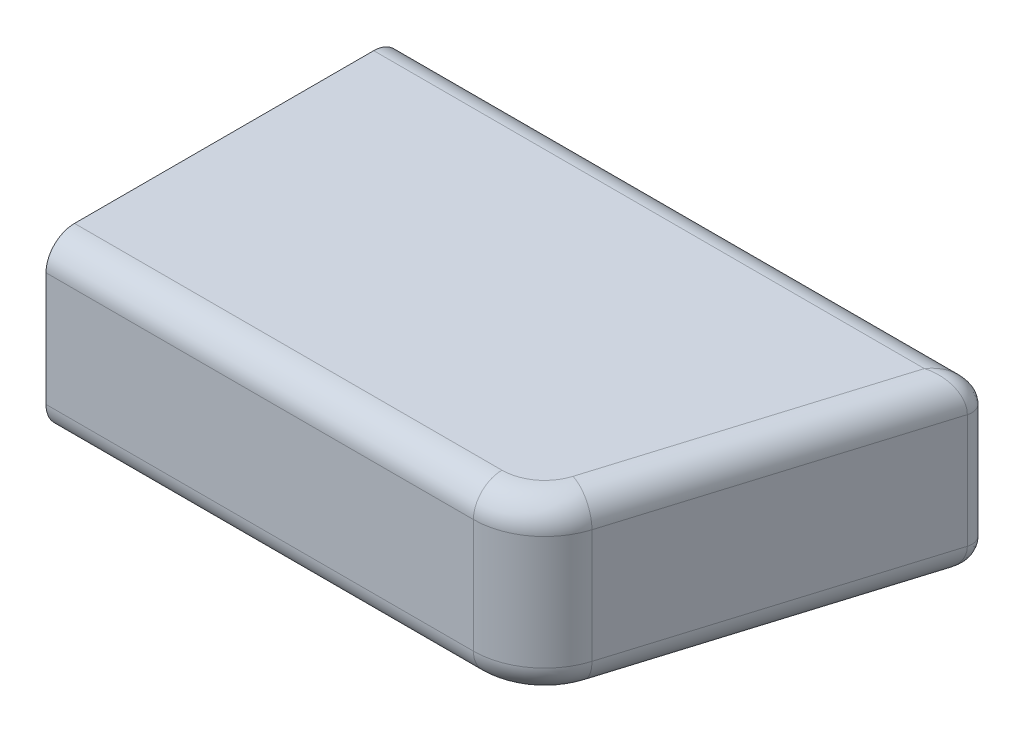
ISO-10303-21;
HEADER;
FILE_DESCRIPTION(('STEP AP214'),'2;1');
FILE_NAME('part.step','',(''),(''),'','','');
FILE_SCHEMA(('AUTOMOTIVE_DESIGN { 1 0 10303 214 1 1 1 1 }'));
ENDSEC;
DATA;
#1=APPLICATION_CONTEXT('core data for automotive mechanical design processes');
#2=APPLICATION_PROTOCOL_DEFINITION('international standard','automotive_design',2000,#1);
#3=PRODUCT_CONTEXT('',#1,'mechanical');
#4=PRODUCT('Part','Part','',(#3));
#5=PRODUCT_RELATED_PRODUCT_CATEGORY('part','',(#4));
#6=PRODUCT_DEFINITION_FORMATION('','',#4);
#7=PRODUCT_DEFINITION_CONTEXT('part definition',#1,'design');
#8=PRODUCT_DEFINITION('design','',#6,#7);
#9=PRODUCT_DEFINITION_SHAPE('','',#8);
#10=(LENGTH_UNIT() NAMED_UNIT(*) SI_UNIT(.MILLI.,.METRE.));
#11=(NAMED_UNIT(*) PLANE_ANGLE_UNIT() SI_UNIT($,.RADIAN.));
#12=(NAMED_UNIT(*) SI_UNIT($,.STERADIAN.) SOLID_ANGLE_UNIT());
#13=UNCERTAINTY_MEASURE_WITH_UNIT(LENGTH_MEASURE(1.E-05),#10,'distance_accuracy_value','');
#14=(GEOMETRIC_REPRESENTATION_CONTEXT(3) GLOBAL_UNCERTAINTY_ASSIGNED_CONTEXT((#13)) GLOBAL_UNIT_ASSIGNED_CONTEXT((#10,
#11,#12)) REPRESENTATION_CONTEXT('',''));
#15=CARTESIAN_POINT('',(0.,0.,0.));
#16=DIRECTION('',(0.,0.,1.));
#17=DIRECTION('',(1.,0.,0.));
#18=AXIS2_PLACEMENT_3D('',#15,#16,#17);
#19=CARTESIAN_POINT('',(32.3335021986805,12.,-16.8831167441114));
#20=DIRECTION('',(0.,0.,1.));
#21=DIRECTION('',(1.,0.,0.));
#22=AXIS2_PLACEMENT_3D('',#19,#20,#21);
#23=PLANE('',#22);
#24=DIRECTION('',(0.,-1.,0.));
#25=VECTOR('',#24,1.);
#26=CARTESIAN_POINT('',(32.3335021986805,12.,-16.8831167441114));
#27=LINE('',#26,#25);
#28=CARTESIAN_POINT('',(32.3335021986805,10.,-16.8831167441114));
#29=VERTEX_POINT('',#28);
#30=CARTESIAN_POINT('',(32.3335021986805,2.,-16.8831167441114));
#31=VERTEX_POINT('',#30);
#32=EDGE_CURVE('E195',#29,#31,#27,.T.);
#33=ORIENTED_EDGE('',*,*,#32,.T.);
#34=DIRECTION('',(-1.,0.,0.));
#35=VECTOR('',#34,1.);
#36=CARTESIAN_POINT('',(32.3335021986805,2.,-16.8831167441114));
#37=LINE('',#36,#35);
#38=CARTESIAN_POINT('',(-7.66649780131954,2.,-16.8831167441114));
#39=VERTEX_POINT('',#38);
#40=EDGE_CURVE('E225',#31,#39,#37,.T.);
#41=ORIENTED_EDGE('',*,*,#40,.T.);
#42=DIRECTION('',(0.,-1.,0.));
#43=VECTOR('',#42,1.);
#44=CARTESIAN_POINT('',(-7.66649780131954,12.,-16.8831167441114));
#45=LINE('',#44,#43);
#46=CARTESIAN_POINT('',(-7.66649780131954,10.,-16.8831167441114));
#47=VERTEX_POINT('',#46);
#48=EDGE_CURVE('E148',#47,#39,#45,.T.);
#49=ORIENTED_EDGE('',*,*,#48,.F.);
#50=DIRECTION('',(-1.,0.,0.));
#51=VECTOR('',#50,1.);
#52=CARTESIAN_POINT('',(32.3335021986805,10.,-16.8831167441114));
#53=LINE('',#52,#51);
#54=EDGE_CURVE('E223',#47,#29,#53,.F.);
#55=ORIENTED_EDGE('',*,*,#54,.T.);
#56=EDGE_LOOP('',(#33,#41,#49,#55));
#57=FACE_BOUND('',#56,.T.);
#58=ADVANCED_FACE('F35',(#57),#23,.F.);
#59=CARTESIAN_POINT('',(-7.66649780131954,12.,-16.8831167441114));
#60=DIRECTION('',(1.,0.,0.));
#61=DIRECTION('',(0.,0.,-1.));
#62=AXIS2_PLACEMENT_3D('',#59,#60,#61);
#63=PLANE('',#62);
#64=DIRECTION('',(0.,0.,1.));
#65=VECTOR('',#64,1.);
#66=CARTESIAN_POINT('',(-7.66649780131954,0.,-16.8831167441114));
#67=LINE('',#66,#65);
#68=CARTESIAN_POINT('',(-7.66649780131954,0.,-14.8831167441114));
#69=VERTEX_POINT('',#68);
#70=CARTESIAN_POINT('',(-7.66649780131953,0.,6.11688325588859));
#71=VERTEX_POINT('',#70);
#72=EDGE_CURVE('E183',#69,#71,#67,.T.);
#73=ORIENTED_EDGE('',*,*,#72,.T.);
#74=CARTESIAN_POINT('',(-7.66649780131953,2.,6.11688325588859));
#75=DIRECTION('',(1.,0.,0.));
#76=DIRECTION('',(0.,0.,-1.));
#77=AXIS2_PLACEMENT_3D('',#74,#75,#76);
#78=CIRCLE('',#77,2.);
#79=CARTESIAN_POINT('',(-7.66649780131953,2.,8.11688325588859));
#80=VERTEX_POINT('',#79);
#81=EDGE_CURVE('E133',#71,#80,#78,.F.);
#82=ORIENTED_EDGE('',*,*,#81,.T.);
#83=DIRECTION('',(0.,-1.,0.));
#84=VECTOR('',#83,1.);
#85=CARTESIAN_POINT('',(-7.66649780131953,12.,8.11688325588859));
#86=LINE('',#85,#84);
#87=CARTESIAN_POINT('',(-7.66649780131953,10.,8.11688325588859));
#88=VERTEX_POINT('',#87);
#89=EDGE_CURVE('E143',#88,#80,#86,.T.);
#90=ORIENTED_EDGE('',*,*,#89,.F.);
#91=CARTESIAN_POINT('',(-7.66649780131954,10.,6.11688325588859));
#92=DIRECTION('',(1.,0.,0.));
#93=DIRECTION('',(0.,0.,-1.));
#94=AXIS2_PLACEMENT_3D('',#91,#92,#93);
#95=CIRCLE('',#94,2.);
#96=CARTESIAN_POINT('',(-7.66649780131953,12.,6.11688325588859));
#97=VERTEX_POINT('',#96);
#98=EDGE_CURVE('E147',#88,#97,#95,.F.);
#99=ORIENTED_EDGE('',*,*,#98,.T.);
#100=DIRECTION('',(0.,0.,1.));
#101=VECTOR('',#100,1.);
#102=CARTESIAN_POINT('',(-7.66649780131954,12.,-16.8831167441114));
#103=LINE('',#102,#101);
#104=CARTESIAN_POINT('',(-7.66649780131954,12.,-14.8831167441114));
#105=VERTEX_POINT('',#104);
#106=EDGE_CURVE('E189',#105,#97,#103,.T.);
#107=ORIENTED_EDGE('',*,*,#106,.F.);
#108=CARTESIAN_POINT('',(-7.66649780131954,10.,-14.8831167441114));
#109=DIRECTION('',(1.,0.,0.));
#110=DIRECTION('',(0.,0.,-1.));
#111=AXIS2_PLACEMENT_3D('',#108,#109,#110);
#112=CIRCLE('',#111,2.);
#113=EDGE_CURVE('E216',#105,#47,#112,.F.);
#114=ORIENTED_EDGE('',*,*,#113,.T.);
#115=ORIENTED_EDGE('',*,*,#48,.T.);
#116=CARTESIAN_POINT('',(-7.66649780131953,2.,-14.8831167441114));
#117=DIRECTION('',(1.,0.,0.));
#118=DIRECTION('',(0.,0.,-1.));
#119=AXIS2_PLACEMENT_3D('',#116,#117,#118);
#120=CIRCLE('',#119,2.);
#121=EDGE_CURVE('E219',#39,#69,#120,.F.);
#122=ORIENTED_EDGE('',*,*,#121,.T.);
#123=EDGE_LOOP('',(#73,#82,#90,#99,#107,#114,#115,#122));
#124=FACE_BOUND('',#123,.T.);
#125=ADVANCED_FACE('F254',(#124),#63,.F.);
#126=CARTESIAN_POINT('',(-7.66649780131953,12.,8.11688325588859));
#127=DIRECTION('',(0.,0.,-1.));
#128=DIRECTION('',(-1.,0.,0.));
#129=AXIS2_PLACEMENT_3D('',#126,#127,#128);
#130=PLANE('',#129);
#131=ORIENTED_EDGE('',*,*,#89,.T.);
#132=DIRECTION('',(1.,0.,0.));
#133=VECTOR('',#132,1.);
#134=CARTESIAN_POINT('',(-7.66649780131953,2.,8.11688325588859));
#135=LINE('',#134,#133);
#136=CARTESIAN_POINT('',(22.3335021986805,2.,8.11688325588859));
#137=VERTEX_POINT('',#136);
#138=EDGE_CURVE('E142',#80,#137,#135,.T.);
#139=ORIENTED_EDGE('',*,*,#138,.T.);
#140=DIRECTION('',(0.,-1.,0.));
#141=VECTOR('',#140,1.);
#142=CARTESIAN_POINT('',(22.3335021986805,12.,8.11688325588859));
#143=LINE('',#142,#141);
#144=CARTESIAN_POINT('',(22.3335021986805,10.,8.11688325588859));
#145=VERTEX_POINT('',#144);
#146=EDGE_CURVE('E126',#145,#137,#143,.T.);
#147=ORIENTED_EDGE('',*,*,#146,.F.);
#148=DIRECTION('',(1.,0.,0.));
#149=VECTOR('',#148,1.);
#150=CARTESIAN_POINT('',(-7.66649780131953,10.,8.11688325588859));
#151=LINE('',#150,#149);
#152=EDGE_CURVE('E139',#145,#88,#151,.F.);
#153=ORIENTED_EDGE('',*,*,#152,.T.);
#154=EDGE_LOOP('',(#131,#139,#147,#153));
#155=FACE_BOUND('',#154,.T.);
#156=ADVANCED_FACE('F138',(#155),#130,.F.);
#157=CARTESIAN_POINT('',(22.3335021986805,12.,3.11688325588859));
#158=DIRECTION('',(0.,-1.,0.));
#159=DIRECTION('',(0.,0.,-1.));
#160=AXIS2_PLACEMENT_3D('',#157,#158,#159);
#161=CYLINDRICAL_SURFACE('',#160,5.);
#162=ORIENTED_EDGE('',*,*,#146,.T.);
#163=CARTESIAN_POINT('',(22.3335021986805,2.,3.11688325588859));
#164=DIRECTION('',(0.,1.,0.));
#165=DIRECTION('',(0.,0.,1.));
#166=AXIS2_PLACEMENT_3D('',#163,#164,#165);
#167=CIRCLE('',#166,5.);
#168=CARTESIAN_POINT('',(27.1144722538307,2.,4.58055170596766));
#169=VERTEX_POINT('',#168);
#170=EDGE_CURVE('E132',#137,#169,#167,.T.);
#171=ORIENTED_EDGE('',*,*,#170,.T.);
#172=DIRECTION('',(0.,-1.,0.));
#173=VECTOR('',#172,1.);
#174=CARTESIAN_POINT('',(27.1144722538307,12.,4.58055170596766));
#175=LINE('',#174,#173);
#176=CARTESIAN_POINT('',(27.1144722538307,10.,4.58055170596766));
#177=VERTEX_POINT('',#176);
#178=EDGE_CURVE('E128',#177,#169,#175,.T.);
#179=ORIENTED_EDGE('',*,*,#178,.F.);
#180=CARTESIAN_POINT('',(22.3335021986805,10.,3.11688325588859));
#181=DIRECTION('',(0.,1.,0.));
#182=DIRECTION('',(0.,0.,1.));
#183=AXIS2_PLACEMENT_3D('',#180,#181,#182);
#184=CIRCLE('',#183,5.);
#185=EDGE_CURVE('E123',#177,#145,#184,.F.);
#186=ORIENTED_EDGE('',*,*,#185,.T.);
#187=EDGE_LOOP('',(#162,#171,#179,#186));
#188=FACE_BOUND('',#187,.T.);
#189=ADVANCED_FACE('F125',(#188),#161,.T.);
#190=CARTESIAN_POINT('',(27.1144722538307,12.,4.58055170596766));
#191=DIRECTION('',(-0.956194011030045,0.,-0.292733690015813));
#192=DIRECTION('',(-0.292733690015813,0.,0.956194011030045));
#193=AXIS2_PLACEMENT_3D('',#190,#191,#192);
#194=PLANE('',#193);
#195=ORIENTED_EDGE('',*,*,#178,.T.);
#196=DIRECTION('',(0.292733690015813,0.,-0.956194011030045));
#197=VECTOR('',#196,1.);
#198=CARTESIAN_POINT('',(27.1144722538307,2.,4.58055170596766));
#199=LINE('',#198,#197);
#200=CARTESIAN_POINT('',(33.2896962097105,2.,-15.5903830540956));
#201=VERTEX_POINT('',#200);
#202=EDGE_CURVE('E11',#169,#201,#199,.T.);
#203=ORIENTED_EDGE('',*,*,#202,.T.);
#204=DIRECTION('',(0.,-1.,0.));
#205=VECTOR('',#204,1.);
#206=CARTESIAN_POINT('',(33.2896962097105,12.,-15.5903830540956));
#207=LINE('',#206,#205);
#208=CARTESIAN_POINT('',(33.2896962097105,10.,-15.5903830540956));
#209=VERTEX_POINT('',#208);
#210=EDGE_CURVE('E200',#209,#201,#207,.T.);
#211=ORIENTED_EDGE('',*,*,#210,.F.);
#212=DIRECTION('',(0.292733690015813,0.,-0.956194011030045));
#213=VECTOR('',#212,1.);
#214=CARTESIAN_POINT('',(27.1144722538307,10.,4.58055170596766));
#215=LINE('',#214,#213);
#216=EDGE_CURVE('E45',#209,#177,#215,.F.);
#217=ORIENTED_EDGE('',*,*,#216,.T.);
#218=EDGE_LOOP('',(#195,#203,#211,#217));
#219=FACE_BOUND('',#218,.T.);
#220=ADVANCED_FACE('F239',(#219),#194,.F.);
#221=CARTESIAN_POINT('',(32.3335021986805,12.,-15.8831167441114));
#222=DIRECTION('',(0.,-1.,0.));
#223=DIRECTION('',(0.,0.,-1.));
#224=AXIS2_PLACEMENT_3D('',#221,#222,#223);
#225=CYLINDRICAL_SURFACE('',#224,1.);
#226=ORIENTED_EDGE('',*,*,#210,.T.);
#227=CARTESIAN_POINT('',(32.3335021986805,2.,-15.8831167441114));
#228=DIRECTION('',(0.,1.,0.));
#229=DIRECTION('',(0.,0.,1.));
#230=AXIS2_PLACEMENT_3D('',#227,#228,#229);
#231=CIRCLE('',#230,1.);
#232=EDGE_CURVE('E229',#201,#31,#231,.T.);
#233=ORIENTED_EDGE('',*,*,#232,.T.);
#234=ORIENTED_EDGE('',*,*,#32,.F.);
#235=CARTESIAN_POINT('',(32.3335021986805,10.,-15.8831167441114));
#236=DIRECTION('',(0.,-1.,0.));
#237=DIRECTION('',(0.,0.,-1.));
#238=AXIS2_PLACEMENT_3D('',#235,#236,#237);
#239=CIRCLE('',#238,1.);
#240=EDGE_CURVE('E227',#29,#209,#239,.T.);
#241=ORIENTED_EDGE('',*,*,#240,.T.);
#242=EDGE_LOOP('',(#226,#233,#234,#241));
#243=FACE_BOUND('',#242,.T.);
#244=ADVANCED_FACE('F246',(#243),#225,.T.);
#245=CARTESIAN_POINT('',(22.3335021986805,12.,3.11688325588859));
#246=DIRECTION('',(0.,1.,0.));
#247=DIRECTION('',(0.,0.,1.));
#248=AXIS2_PLACEMENT_3D('',#245,#246,#247);
#249=PLANE('',#248);
#250=ORIENTED_EDGE('',*,*,#106,.T.);
#251=DIRECTION('',(1.,0.,0.));
#252=VECTOR('',#251,1.);
#253=CARTESIAN_POINT('',(22.3335021986805,12.,6.11688325588859));
#254=LINE('',#253,#252);
#255=CARTESIAN_POINT('',(22.3335021986805,12.,6.11688325588859));
#256=VERTEX_POINT('',#255);
#257=EDGE_CURVE('E235',#97,#256,#254,.T.);
#258=ORIENTED_EDGE('',*,*,#257,.T.);
#259=CARTESIAN_POINT('',(22.3335021986805,12.,3.11688325588859));
#260=DIRECTION('',(0.,1.,0.));
#261=DIRECTION('',(0.,0.,1.));
#262=AXIS2_PLACEMENT_3D('',#259,#260,#261);
#263=CIRCLE('',#262,3.);
#264=CARTESIAN_POINT('',(25.2020842317706,12.,3.99508432593603));
#265=VERTEX_POINT('',#264);
#266=EDGE_CURVE('E151',#256,#265,#263,.T.);
#267=ORIENTED_EDGE('',*,*,#266,.T.);
#268=DIRECTION('',(0.292733690015813,0.,-0.956194011030045));
#269=VECTOR('',#268,1.);
#270=CARTESIAN_POINT('',(31.3773081876504,12.,-16.1758504341272));
#271=LINE('',#270,#269);
#272=CARTESIAN_POINT('',(30.9815446721705,12.,-14.8831167441114));
#273=VERTEX_POINT('',#272);
#274=EDGE_CURVE('E61',#265,#273,#271,.T.);
#275=ORIENTED_EDGE('',*,*,#274,.T.);
#276=DIRECTION('',(-1.,0.,0.));
#277=VECTOR('',#276,1.);
#278=CARTESIAN_POINT('',(-7.66649780131954,12.,-14.8831167441114));
#279=LINE('',#278,#277);
#280=EDGE_CURVE('E232',#273,#105,#279,.T.);
#281=ORIENTED_EDGE('',*,*,#280,.T.);
#282=EDGE_LOOP('',(#250,#258,#267,#275,#281));
#283=FACE_BOUND('',#282,.T.);
#284=ADVANCED_FACE('F253',(#283),#249,.T.);
#285=CARTESIAN_POINT('',(22.3335021986805,0.,3.11688325588859));
#286=DIRECTION('',(0.,1.,0.));
#287=DIRECTION('',(0.,0.,1.));
#288=AXIS2_PLACEMENT_3D('',#285,#286,#287);
#289=PLANE('',#288);
#290=CARTESIAN_POINT('',(22.3335021986805,0.,3.11688325588859));
#291=DIRECTION('',(0.,1.,0.));
#292=DIRECTION('',(0.,0.,1.));
#293=AXIS2_PLACEMENT_3D('',#290,#291,#292);
#294=CIRCLE('',#293,3.);
#295=CARTESIAN_POINT('',(25.2020842317706,0.,3.99508432593603));
#296=VERTEX_POINT('',#295);
#297=CARTESIAN_POINT('',(22.3335021986805,0.,6.11688325588859));
#298=VERTEX_POINT('',#297);
#299=EDGE_CURVE('E212',#296,#298,#294,.F.);
#300=ORIENTED_EDGE('',*,*,#299,.T.);
#301=DIRECTION('',(1.,0.,0.));
#302=VECTOR('',#301,1.);
#303=CARTESIAN_POINT('',(22.3335021986805,0.,6.11688325588859));
#304=LINE('',#303,#302);
#305=EDGE_CURVE('E214',#298,#71,#304,.F.);
#306=ORIENTED_EDGE('',*,*,#305,.T.);
#307=ORIENTED_EDGE('',*,*,#72,.F.);
#308=DIRECTION('',(-1.,0.,0.));
#309=VECTOR('',#308,1.);
#310=CARTESIAN_POINT('',(22.3335021986805,0.,-14.8831167441114));
#311=LINE('',#310,#309);
#312=CARTESIAN_POINT('',(30.9815446721705,0.,-14.8831167441114));
#313=VERTEX_POINT('',#312);
#314=EDGE_CURVE('E210',#69,#313,#311,.F.);
#315=ORIENTED_EDGE('',*,*,#314,.T.);
#316=DIRECTION('',(0.292733690015813,0.,-0.956194011030045));
#317=VECTOR('',#316,1.);
#318=CARTESIAN_POINT('',(25.2020842317706,0.,3.99508432593603));
#319=LINE('',#318,#317);
#320=EDGE_CURVE('E208',#313,#296,#319,.F.);
#321=ORIENTED_EDGE('',*,*,#320,.T.);
#322=EDGE_LOOP('',(#300,#306,#307,#315,#321));
#323=FACE_BOUND('',#322,.T.);
#324=ADVANCED_FACE('F274',(#323),#289,.F.);
#325=CARTESIAN_POINT('',(32.3335021986805,2.,-14.8831167441114));
#326=DIRECTION('',(-1.,0.,0.));
#327=DIRECTION('',(0.,0.,1.));
#328=AXIS2_PLACEMENT_3D('',#325,#326,#327);
#329=CYLINDRICAL_SURFACE('',#328,2.);
#330=ORIENTED_EDGE('',*,*,#121,.F.);
#331=ORIENTED_EDGE('',*,*,#40,.F.);
#332=CARTESIAN_POINT('',(30.9815446721705,2.,-14.8831167441114));
#333=DIRECTION('',(0.828472467690034,0.,0.560029794099908));
#334=DIRECTION('',(0.560029794099908,0.,-0.828472467690034));
#335=AXIS2_PLACEMENT_3D('',#332,#333,#334);
#336=ELLIPSE('',#335,2.41408143058326,2.);
#337=EDGE_CURVE('E181',#313,#31,#336,.T.);
#338=ORIENTED_EDGE('',*,*,#337,.F.);
#339=ORIENTED_EDGE('',*,*,#314,.F.);
#340=EDGE_LOOP('',(#330,#331,#338,#339));
#341=FACE_BOUND('',#340,.T.);
#342=ADVANCED_FACE('F267',(#341),#329,.T.);
#343=CARTESIAN_POINT('',(30.9815446721705,4.,-14.8831167441114));
#344=CARTESIAN_POINT('',(30.9815446721705,4.,-14.8831167441114));
#345=CARTESIAN_POINT('',(30.9815446721705,4.,-14.8831167441114));
#346=CARTESIAN_POINT('',(31.0820571781341,3.99994233991153,-14.9139158957459));
#347=CARTESIAN_POINT('',(31.0612532713887,3.99999437343622,-14.9420746608027));
#348=CARTESIAN_POINT('',(31.0404180332717,3.99994233991153,-14.9702102510401));
#349=CARTESIAN_POINT('',(31.1825944055609,3.99430697680965,-14.9447226225582));
#350=CARTESIAN_POINT('',(31.1412471328849,3.99798229289744,-15.0012435769319));
#351=CARTESIAN_POINT('',(31.0993058745176,3.99430697680965,-15.0573251789741));
#352=CARTESIAN_POINT('',(31.3819400433067,3.97159815969771,-15.00580633016));
#353=CARTESIAN_POINT('',(31.3006766707529,3.9898912762768,-15.1191685373998));
#354=CARTESIAN_POINT('',(31.2160689340239,3.97159815969771,-15.2300570247854));
#355=CARTESIAN_POINT('',(31.4807553013194,3.9546513090683,-15.0360854092274));
#356=CARTESIAN_POINT('',(31.3807026204632,3.98379752930757,-15.1783611881607));
#357=CARTESIAN_POINT('',(31.2739481631956,3.9546513090683,-15.3156798761499));
#358=CARTESIAN_POINT('',(31.6749746317223,3.90955046295957,-15.0955983081457));
#359=CARTESIAN_POINT('',(31.5403033172648,3.96739805696633,-15.2964127494502));
#360=CARTESIAN_POINT('',(31.3877085819815,3.90955046295957,-15.4839698062036));
#361=CARTESIAN_POINT('',(31.7704060501632,3.88164958866861,-15.1248405074032));
#362=CARTESIAN_POINT('',(31.6204739382346,3.95706240582472,-15.3557124089423));
#363=CARTESIAN_POINT('',(31.4436057890445,3.8816495886686,-15.566660580088));
#364=CARTESIAN_POINT('',(31.9561978746066,3.81496967869212,-15.1817710407595));
#365=CARTESIAN_POINT('',(31.7806530426299,3.93178815925032,-15.4741917999398));
#366=CARTESIAN_POINT('',(31.5524299504287,3.81496967869211,-15.7276481248152));
#367=CARTESIAN_POINT('',(32.0466222992479,3.77657353944393,-15.2094789915194));
#368=CARTESIAN_POINT('',(31.8612636268667,3.91680520063407,-15.5338168862728));
#369=CARTESIAN_POINT('',(31.605394402496,3.77657353944393,-15.8060003674393));
#370=CARTESIAN_POINT('',(32.2208154064173,3.6894306749134,-15.2628554332862));
#371=CARTESIAN_POINT('',(32.0228483042158,3.88138384030836,-15.6533359348972));
#372=CARTESIAN_POINT('',(31.7074248274805,3.6894306749134,-15.9569376905191));
#373=CARTESIAN_POINT('',(32.3047033836669,3.64119637962372,-15.2885604787116));
#374=CARTESIAN_POINT('',(32.1044217453433,3.86089149232359,-15.7136732158605));
#375=CARTESIAN_POINT('',(31.7565606750978,3.64119637962373,-16.0296261391632));
#376=CARTESIAN_POINT('',(32.464329621962,3.53506503306765,-15.3374733246403));
#377=CARTESIAN_POINT('',(32.2686830844752,3.8127482404957,-15.8351721061074));
#378=CARTESIAN_POINT('',(31.8500588231967,3.53506503306766,-16.1679413543464));
#379=CARTESIAN_POINT('',(32.5402646753155,3.47780480378089,-15.3607414264569));
#380=CARTESIAN_POINT('',(32.3519453535642,3.78504942103507,-15.8967585594215));
#381=CARTESIAN_POINT('',(31.8945363911715,3.47780480378089,-16.2337386402857));
#382=CARTESIAN_POINT('',(32.6826037812164,3.35446961303308,-15.4043571304346));
#383=CARTESIAN_POINT('',(32.5203384284106,3.71935460810268,-16.0213135632174));
#384=CARTESIAN_POINT('',(31.9779089178058,3.35446961303308,-16.3570746549155));
#385=CARTESIAN_POINT('',(32.749306518152,3.2891375350601,-15.4247962557914));
#386=CARTESIAN_POINT('',(32.6059756748777,3.68135614170703,-16.0846567117912));
#387=CARTESIAN_POINT('',(32.01697882538,3.2891375350601,-16.4148721919063));
#388=CARTESIAN_POINT('',(32.8719307065929,3.15066411414271,-15.4623708932721));
#389=CARTESIAN_POINT('',(32.7791877061324,3.58977920702354,-16.2127761444348));
#390=CARTESIAN_POINT('',(32.0888036998731,3.15066411414271,-16.5211253442202));
#391=CARTESIAN_POINT('',(32.9282739650429,3.07832951833868,-15.4796356559396));
#392=CARTESIAN_POINT('',(32.8671307054857,3.53633109530218,-16.2778247851124));
#393=CARTESIAN_POINT('',(32.1218057324912,3.07832951833868,-16.569946452829));
#394=CARTESIAN_POINT('',(33.0290822734341,2.92702693289033,-15.5105254476764));
#395=CARTESIAN_POINT('',(33.0427983853241,3.40609335261255,-16.4077605829416));
#396=CARTESIAN_POINT('',(32.1808523544515,2.92702693289032,-16.6572962708558));
#397=CARTESIAN_POINT('',(33.0740961189399,2.84885081739926,-15.5243186392807));
#398=CARTESIAN_POINT('',(33.1306585562061,3.32974106571898,-16.4727479580324));
#399=CARTESIAN_POINT('',(32.2072183907533,2.84885081739926,-16.6963005084665));
#400=CARTESIAN_POINT('',(33.1513396721131,2.68724203502928,-15.5479876930384));
#401=CARTESIAN_POINT('',(33.2992963588088,3.14493717552186,-16.5974839791691));
#402=CARTESIAN_POINT('',(32.2524623885534,2.68724203502928,-16.7632316019558));
#403=CARTESIAN_POINT('',(33.1842045446853,2.60446895238427,-15.5580581831142));
#404=CARTESIAN_POINT('',(33.3798980092855,3.03752773392134,-16.6571024574839));
#405=CARTESIAN_POINT('',(32.271712386272,2.60446895238428,-16.7917088245624));
#406=CARTESIAN_POINT('',(33.2365088691816,2.43527857193943,-15.5740853312373));
#407=CARTESIAN_POINT('',(33.5206400745686,2.78637561663043,-16.7612048886056));
#408=CARTESIAN_POINT('',(32.3023486872348,2.43527857193943,-16.8370302201862));
#409=CARTESIAN_POINT('',(33.2565525128976,2.3492684236929,-15.5802271263921));
#410=CARTESIAN_POINT('',(33.5803425710979,2.64464616239631,-16.8053649271857));
#411=CARTESIAN_POINT('',(32.3140888847651,2.34926842369291,-16.8543979219077));
#412=CARTESIAN_POINT('',(33.2829543270673,2.17542061745816,-15.5883171990675));
#413=CARTESIAN_POINT('',(33.6629545315908,2.33381348440849,-16.8664703679063));
#414=CARTESIAN_POINT('',(32.3295532642911,2.17542061745816,-16.8772749416703));
#415=CARTESIAN_POINT('',(33.2896962097105,2.08771030872908,-15.5903830540956));
#416=CARTESIAN_POINT('',(33.6854597251904,2.16780878715313,-16.8831167441114));
#417=CARTESIAN_POINT('',(32.3335021986805,2.08771030872908,-16.8831167441114));
#418=CARTESIAN_POINT('',(33.2896962097105,1.91228969127092,-15.5903830540956));
#419=CARTESIAN_POINT('',(33.6854597251904,1.83219121284687,-16.8831167441114));
#420=CARTESIAN_POINT('',(32.3335021986805,1.91228969127092,-16.8831167441114));
#421=CARTESIAN_POINT('',(33.2829543270673,1.82457938254184,-15.5883171990675));
#422=CARTESIAN_POINT('',(33.6629545315908,1.66618651559151,-16.8664703679063));
#423=CARTESIAN_POINT('',(32.3295532642911,1.82457938254184,-16.8772749416703));
#424=CARTESIAN_POINT('',(33.2565525128976,1.6507315763071,-15.5802271263921));
#425=CARTESIAN_POINT('',(33.5803425710979,1.35535383760369,-16.8053649271857));
#426=CARTESIAN_POINT('',(32.3140888847651,1.6507315763071,-16.8543979219077));
#427=CARTESIAN_POINT('',(33.2365088691816,1.56472142806057,-15.5740853312373));
#428=CARTESIAN_POINT('',(33.5206400745686,1.21362438336958,-16.7612048886056));
#429=CARTESIAN_POINT('',(32.3023486872348,1.56472142806057,-16.8370302201862));
#430=CARTESIAN_POINT('',(33.1842045446853,1.39553104761573,-15.5580581831142));
#431=CARTESIAN_POINT('',(33.3798980092855,0.962472266078665,-16.6571024574839));
#432=CARTESIAN_POINT('',(32.271712386272,1.39553104761572,-16.7917088245624));
#433=CARTESIAN_POINT('',(33.1513396721131,1.31275796497072,-15.5479876930384));
#434=CARTESIAN_POINT('',(33.2992963588088,0.855062824478137,-16.5974839791691));
#435=CARTESIAN_POINT('',(32.2524623885534,1.31275796497072,-16.7632316019558));
#436=CARTESIAN_POINT('',(33.0740961189399,1.15114918260073,-15.5243186392807));
#437=CARTESIAN_POINT('',(33.1306585562061,0.670258934281022,-16.4727479580324));
#438=CARTESIAN_POINT('',(32.2072183907533,1.15114918260074,-16.6963005084665));
#439=CARTESIAN_POINT('',(33.0290822734341,1.07297306710967,-15.5105254476764));
#440=CARTESIAN_POINT('',(33.0427983853241,0.593906647387446,-16.4077605829416));
#441=CARTESIAN_POINT('',(32.1808523544515,1.07297306710968,-16.6572962708558));
#442=CARTESIAN_POINT('',(32.9282739650429,0.921670481661319,-15.4796356559396));
#443=CARTESIAN_POINT('',(32.8671307054857,0.463668904697818,-16.2778247851124));
#444=CARTESIAN_POINT('',(32.1218057324912,0.921670481661319,-16.569946452829));
#445=CARTESIAN_POINT('',(32.8719307065929,0.849335885857293,-15.4623708932721));
#446=CARTESIAN_POINT('',(32.7791877061324,0.410220792976459,-16.2127761444347));
#447=CARTESIAN_POINT('',(32.0888036998731,0.849335885857291,-16.5211253442202));
#448=CARTESIAN_POINT('',(32.749306518152,0.710862464939901,-15.4247962557914));
#449=CARTESIAN_POINT('',(32.6059756748777,0.31864385829297,-16.0846567117912));
#450=CARTESIAN_POINT('',(32.01697882538,0.710862464939899,-16.4148721919063));
#451=CARTESIAN_POINT('',(32.6826037812164,0.645530386966918,-15.4043571304346));
#452=CARTESIAN_POINT('',(32.5203384284106,0.280645391897316,-16.0213135632174));
#453=CARTESIAN_POINT('',(31.9779089178058,0.64553038696692,-16.3570746549155));
#454=CARTESIAN_POINT('',(32.5402646753155,0.522195196219112,-15.3607414264569));
#455=CARTESIAN_POINT('',(32.3519453535642,0.214950578964932,-15.8967585594215));
#456=CARTESIAN_POINT('',(31.8945363911715,0.522195196219114,-16.2337386402857));
#457=CARTESIAN_POINT('',(32.464329621962,0.464934966932346,-15.3374733246403));
#458=CARTESIAN_POINT('',(32.2686830844752,0.187251759504297,-15.8351721061074));
#459=CARTESIAN_POINT('',(31.8500588231967,0.464934966932345,-16.1679413543464));
#460=CARTESIAN_POINT('',(32.3047033836669,0.358803620376276,-15.2885604787116));
#461=CARTESIAN_POINT('',(32.1044217453433,0.139108507676416,-15.7136732158605));
#462=CARTESIAN_POINT('',(31.7565606750978,0.358803620376275,-16.0296261391632));
#463=CARTESIAN_POINT('',(32.2208154064173,0.310569325086602,-15.2628554332862));
#464=CARTESIAN_POINT('',(32.0228483042158,0.118616159691641,-15.6533359348972));
#465=CARTESIAN_POINT('',(31.7074248274805,0.310569325086604,-15.9569376905191));
#466=CARTESIAN_POINT('',(32.0466222992479,0.223426460556071,-15.2094789915194));
#467=CARTESIAN_POINT('',(31.8612636268667,0.0831947993659327,-15.5338168862728));
#468=CARTESIAN_POINT('',(31.605394402496,0.223426460556074,-15.8060003674394));
#469=CARTESIAN_POINT('',(31.9561978746066,0.185030321307889,-15.1817710407595));
#470=CARTESIAN_POINT('',(31.7806530426299,0.0682118407496763,-15.4741917999397));
#471=CARTESIAN_POINT('',(31.5524299504287,0.185030321307888,-15.7276481248152));
#472=CARTESIAN_POINT('',(31.7704060501632,0.118350411331397,-15.1248405074032));
#473=CARTESIAN_POINT('',(31.6204739382346,0.0429375941752766,-15.3557124089423));
#474=CARTESIAN_POINT('',(31.4436057890445,0.118350411331395,-15.566660580088));
#475=CARTESIAN_POINT('',(31.6749746317223,0.0904495370404332,-15.0955983081457));
#476=CARTESIAN_POINT('',(31.5403033172648,0.0326019430336718,-15.2964127494502));
#477=CARTESIAN_POINT('',(31.3877085819815,0.0904495370404332,-15.4839698062036));
#478=CARTESIAN_POINT('',(31.4807553013194,0.045348690931701,-15.0360854092274));
#479=CARTESIAN_POINT('',(31.3807026204632,0.0162024706924329,-15.1783611881607));
#480=CARTESIAN_POINT('',(31.2739481631956,0.0453486909317027,-15.3156798761499));
#481=CARTESIAN_POINT('',(31.3819400433067,0.0284018403022856,-15.00580633016));
#482=CARTESIAN_POINT('',(31.3006766707529,0.0101087237231992,-15.1191685373998));
#483=CARTESIAN_POINT('',(31.2160689340239,0.0284018403022864,-15.2300570247854));
#484=CARTESIAN_POINT('',(31.1825944055609,0.00569302319034916,-14.9447226225581));
#485=CARTESIAN_POINT('',(31.1412471328849,0.00201770710256292,-15.0012435769319));
#486=CARTESIAN_POINT('',(31.0993058745176,0.00569302319034836,-15.0573251789741));
#487=CARTESIAN_POINT('',(31.0820571781341,5.76600884663281E-05,-14.9139158957459));
#488=CARTESIAN_POINT('',(31.0612532713887,5.62656377765871E-06,-14.9420746608027));
#489=CARTESIAN_POINT('',(31.0404180332717,5.76600884648775E-05,-14.9702102510401));
#490=CARTESIAN_POINT('',(30.9815446721705,0.,-14.8831167441114));
#491=CARTESIAN_POINT('',(30.9815446721705,0.,-14.8831167441114));
#492=CARTESIAN_POINT('',(30.9815446721705,0.,-14.8831167441114));
#493=(BOUNDED_SURFACE() B_SPLINE_SURFACE(3,2,((#343,#344,#345),(#346,#347,#348),(#349,#350,
#351),(#352,#353,#354),(#355,#356,#357),(#358,#359,#360),(#361,#362,#363),(#364,#365,#366),
(#367,#368,#369),(#370,#371,#372),(#373,#374,#375),(#376,#377,#378),(#379,#380,#381),(#382,#383,
#384),(#385,#386,#387),(#388,#389,#390),(#391,#392,#393),(#394,#395,#396),(#397,#398,#399),
(#400,#401,#402),(#403,#404,#405),(#406,#407,#408),(#409,#410,#411),(#412,#413,#414),(#415,#416,
#417),(#418,#419,#420),(#421,#422,#423),(#424,#425,#426),(#427,#428,#429),(#430,#431,#432),
(#433,#434,#435),(#436,#437,#438),(#439,#440,#441),(#442,#443,#444),(#445,#446,#447),(#448,#449,
#450),(#451,#452,#453),(#454,#455,#456),(#457,#458,#459),(#460,#461,#462),(#463,#464,#465),
(#466,#467,#468),(#469,#470,#471),(#472,#473,#474),(#475,#476,#477),(#478,#479,#480),(#481,#482,
#483),(#484,#485,#486),(#487,#488,#489),(#490,#491,#492)),.UNSPECIFIED.,.F.,.F.,
.F.) B_SPLINE_SURFACE_WITH_KNOTS((4,2,2,2,2,2,2,2,2,2,2,2,2,2,2,2,2,2,2,2,2,2,2,2,4),(3,3),(0.,
0.219659918541853,0.436901630627522,0.649393806392344,0.854981896919501,1.05178454854574,
1.23830077719233,1.41353270958841,1.57712748332123,1.72953506421276,1.87215907663192,
2.00743868414872,2.13875530101801,2.2700719178873,2.40535152540409,2.54797553782326,
2.70038311871479,2.86397789244761,3.03920982484369,3.22572605349028,3.42252870511652,
3.62811679564367,3.8406089714085,4.05785068349416,4.27751060203602),(0.,1.),
.UNSPECIFIED.) GEOMETRIC_REPRESENTATION_ITEM() RATIONAL_B_SPLINE_SURFACE(((1.,1.,1.),(1.,
0.999995063886946,1.),(1.,0.998161000575726,1.),(1.,0.990836844541165,1.),(1.,0.985387222832688,
1.),(1.,0.970994365365025,1.),(1.,0.962130115028348,1.),(1.,0.941204429866274,1.),(1.,
0.929256232476361,1.),(1.,0.902618115432155,1.),(1.,0.888067177297177,1.),(1.,0.856860399462726,
1.),(1.,0.840354330034889,1.),(1.,0.806091705690393,1.),(1.,0.788471222608102,1.),(1.,
0.753095113156044,1.),(1.,0.735426173144079,1.),(1.,0.701363056383866,1.),(1.,0.684964332247658,
1.),(1.,0.655116761261014,1.),(1.,0.641546127456654,1.),(1.,0.619097186910702,1.),(1.,
0.61001323494205,1.),(1.,0.597884515673622,1.),(1.,0.594670627315736,1.),(1.,0.594670627315736,
1.),(1.,0.597884515673622,1.),(1.,0.61001323494205,1.),(1.,0.619097186910702,1.),(1.,
0.641546127456654,1.),(1.,0.655116761261014,1.),(1.,0.684964332247658,1.),(1.,0.701363056383866,
1.),(1.,0.735426173144079,1.),(1.,0.753095113156044,1.),(1.,0.788471222608101,1.),(1.,
0.806091705690392,1.),(1.,0.840354330034889,1.),(1.,0.856860399462726,1.),(1.,0.888067177297177,
1.),(1.,0.902618115432155,1.),(1.,0.929256232476361,1.),(1.,0.941204429866273,1.),(1.,
0.962130115028348,1.),(1.,0.970994365365024,1.),(1.,0.985387222832688,1.),(1.,0.990836844541165,
1.),(1.,0.998161000575726,1.),(1.,0.999995063886946,1.),(1.,1.,1.))) REPRESENTATION_ITEM('') SURFACE());
#494=ORIENTED_EDGE('',*,*,#337,.T.);
#495=ORIENTED_EDGE('',*,*,#232,.F.);
#496=CARTESIAN_POINT('',(30.9815446721705,2.,-14.8831167441114));
#497=DIRECTION('',(0.29297533257331,0.,0.956120000054155));
#498=DIRECTION('',(0.956120000054155,0.,-0.29297533257331));
#499=AXIS2_PLACEMENT_3D('',#496,#497,#498);
#500=ELLIPSE('',#499,2.41408143058326,2.);
#501=EDGE_CURVE('E176',#313,#201,#500,.T.);
#502=ORIENTED_EDGE('',*,*,#501,.F.);
#503=EDGE_LOOP('',(#494,#495,#502));
#504=FACE_BOUND('',#503,.T.);
#505=ADVANCED_FACE('F265',(#504),#493,.T.);
#506=CARTESIAN_POINT('',(25.2020842317706,2.,3.99508432593603));
#507=DIRECTION('',(0.292733690015813,0.,-0.956194011030045));
#508=DIRECTION('',(-0.956194011030045,0.,-0.292733690015813));
#509=AXIS2_PLACEMENT_3D('',#506,#507,#508);
#510=CYLINDRICAL_SURFACE('',#509,2.);
#511=ORIENTED_EDGE('',*,*,#501,.T.);
#512=ORIENTED_EDGE('',*,*,#202,.F.);
#513=CARTESIAN_POINT('',(25.2020842317706,2.,3.99508432593603));
#514=DIRECTION('',(-0.292733690015813,0.,0.956194011030045));
#515=DIRECTION('',(0.956194011030045,0.,0.292733690015813));
#516=AXIS2_PLACEMENT_3D('',#513,#514,#515);
#517=CIRCLE('',#516,2.);
#518=EDGE_CURVE('E169',#296,#169,#517,.T.);
#519=ORIENTED_EDGE('',*,*,#518,.F.);
#520=ORIENTED_EDGE('',*,*,#320,.F.);
#521=EDGE_LOOP('',(#511,#512,#519,#520));
#522=FACE_BOUND('',#521,.T.);
#523=ADVANCED_FACE('F264',(#522),#510,.T.);
#524=CARTESIAN_POINT('',(22.3335021986805,2.,3.11688325588859));
#525=DIRECTION('',(0.,1.,0.));
#526=DIRECTION('',(0.,0.,1.));
#527=AXIS2_PLACEMENT_3D('',#524,#525,#526);
#528=TOROIDAL_SURFACE('',#527,3.,2.);
#529=ORIENTED_EDGE('',*,*,#518,.T.);
#530=ORIENTED_EDGE('',*,*,#170,.F.);
#531=CARTESIAN_POINT('',(22.3335021986805,2.,6.11688325588859));
#532=DIRECTION('',(-1.,0.,0.));
#533=DIRECTION('',(0.,0.,1.));
#534=AXIS2_PLACEMENT_3D('',#531,#532,#533);
#535=CIRCLE('',#534,2.);
#536=EDGE_CURVE('E164',#298,#137,#535,.T.);
#537=ORIENTED_EDGE('',*,*,#536,.F.);
#538=ORIENTED_EDGE('',*,*,#299,.F.);
#539=EDGE_LOOP('',(#529,#530,#537,#538));
#540=FACE_BOUND('',#539,.T.);
#541=ADVANCED_FACE('F260',(#540),#528,.T.);
#542=CARTESIAN_POINT('',(-7.66649780131953,2.,6.11688325588859));
#543=DIRECTION('',(1.,0.,0.));
#544=DIRECTION('',(0.,0.,-1.));
#545=AXIS2_PLACEMENT_3D('',#542,#543,#544);
#546=CYLINDRICAL_SURFACE('',#545,2.);
#547=ORIENTED_EDGE('',*,*,#81,.F.);
#548=ORIENTED_EDGE('',*,*,#305,.F.);
#549=ORIENTED_EDGE('',*,*,#536,.T.);
#550=ORIENTED_EDGE('',*,*,#138,.F.);
#551=EDGE_LOOP('',(#547,#548,#549,#550));
#552=FACE_BOUND('',#551,.T.);
#553=ADVANCED_FACE('F256',(#552),#546,.T.);
#554=CARTESIAN_POINT('',(22.3335021986805,10.,-14.8831167441114));
#555=DIRECTION('',(1.,0.,0.));
#556=DIRECTION('',(0.,0.,-1.));
#557=AXIS2_PLACEMENT_3D('',#554,#555,#556);
#558=CYLINDRICAL_SURFACE('',#557,2.);
#559=ORIENTED_EDGE('',*,*,#113,.F.);
#560=ORIENTED_EDGE('',*,*,#280,.F.);
#561=CARTESIAN_POINT('',(30.9815446721705,10.,-14.8831167441114));
#562=DIRECTION('',(-0.828472467690034,0.,-0.560029794099908));
#563=DIRECTION('',(0.560029794099908,0.,-0.828472467690034));
#564=AXIS2_PLACEMENT_3D('',#561,#562,#563);
#565=ELLIPSE('',#564,2.41408143058326,2.);
#566=EDGE_CURVE('E162',#29,#273,#565,.F.);
#567=ORIENTED_EDGE('',*,*,#566,.F.);
#568=ORIENTED_EDGE('',*,*,#54,.F.);
#569=EDGE_LOOP('',(#559,#560,#567,#568));
#570=FACE_BOUND('',#569,.T.);
#571=ADVANCED_FACE('F37',(#570),#558,.T.);
#572=CARTESIAN_POINT('',(30.9815446721705,8.,-14.8831167441114));
#573=CARTESIAN_POINT('',(30.9815446721705,8.,-14.8831167441114));
#574=CARTESIAN_POINT('',(30.9815446721705,8.,-14.8831167441114));
#575=CARTESIAN_POINT('',(31.0404180332717,8.00005766008847,-14.9702102510401));
#576=CARTESIAN_POINT('',(31.0612532713887,8.00000562656378,-14.9420746608027));
#577=CARTESIAN_POINT('',(31.0820571781341,8.00005766008846,-14.9139158957459));
#578=CARTESIAN_POINT('',(31.0993058745176,8.00569302319035,-15.0573251789741));
#579=CARTESIAN_POINT('',(31.1412471328849,8.00201770710257,-15.0012435769319));
#580=CARTESIAN_POINT('',(31.1825944055609,8.00569302319035,-14.9447226225582));
#581=CARTESIAN_POINT('',(31.2160689340239,8.02840184030229,-15.2300570247854));
#582=CARTESIAN_POINT('',(31.3006766707529,8.0101087237232,-15.1191685373998));
#583=CARTESIAN_POINT('',(31.3819400433067,8.02840184030229,-15.00580633016));
#584=CARTESIAN_POINT('',(31.2739481631956,8.0453486909317,-15.3156798761499));
#585=CARTESIAN_POINT('',(31.3807026204632,8.01620247069243,-15.1783611881607));
#586=CARTESIAN_POINT('',(31.4807553013194,8.0453486909317,-15.0360854092274));
#587=CARTESIAN_POINT('',(31.3877085819815,8.09044953704043,-15.4839698062036));
#588=CARTESIAN_POINT('',(31.5403033172648,8.03260194303367,-15.2964127494502));
#589=CARTESIAN_POINT('',(31.6749746317223,8.09044953704043,-15.0955983081457));
#590=CARTESIAN_POINT('',(31.4436057890445,8.1183504113314,-15.566660580088));
#591=CARTESIAN_POINT('',(31.6204739382346,8.04293759417528,-15.3557124089423));
#592=CARTESIAN_POINT('',(31.7704060501632,8.11835041133139,-15.1248405074032));
#593=CARTESIAN_POINT('',(31.5524299504287,8.18503032130789,-15.7276481248152));
#594=CARTESIAN_POINT('',(31.7806530426299,8.06821184074968,-15.4741917999398));
#595=CARTESIAN_POINT('',(31.9561978746066,8.18503032130788,-15.1817710407595));
#596=CARTESIAN_POINT('',(31.605394402496,8.22342646055607,-15.8060003674394));
#597=CARTESIAN_POINT('',(31.8612636268667,8.08319479936593,-15.5338168862728));
#598=CARTESIAN_POINT('',(32.0466222992479,8.22342646055607,-15.2094789915194));
#599=CARTESIAN_POINT('',(31.7074248274805,8.3105693250866,-15.9569376905191));
#600=CARTESIAN_POINT('',(32.0228483042158,8.11861615969164,-15.6533359348972));
#601=CARTESIAN_POINT('',(32.2208154064173,8.3105693250866,-15.2628554332862));
#602=CARTESIAN_POINT('',(31.7565606750978,8.35880362037627,-16.0296261391632));
#603=CARTESIAN_POINT('',(32.1044217453433,8.13910850767642,-15.7136732158605));
#604=CARTESIAN_POINT('',(32.3047033836669,8.35880362037627,-15.2885604787116));
#605=CARTESIAN_POINT('',(31.8500588231967,8.46493496693235,-16.1679413543464));
#606=CARTESIAN_POINT('',(32.2686830844752,8.1872517595043,-15.8351721061074));
#607=CARTESIAN_POINT('',(32.464329621962,8.46493496693234,-15.3374733246403));
#608=CARTESIAN_POINT('',(31.8945363911715,8.52219519621911,-16.2337386402857));
#609=CARTESIAN_POINT('',(32.3519453535642,8.21495057896493,-15.8967585594215));
#610=CARTESIAN_POINT('',(32.5402646753155,8.52219519621911,-15.3607414264569));
#611=CARTESIAN_POINT('',(31.9779089178058,8.64553038696692,-16.3570746549155));
#612=CARTESIAN_POINT('',(32.5203384284106,8.28064539189731,-16.0213135632174));
#613=CARTESIAN_POINT('',(32.6826037812164,8.64553038696692,-15.4043571304346));
#614=CARTESIAN_POINT('',(32.01697882538,8.7108624649399,-16.4148721919063));
#615=CARTESIAN_POINT('',(32.6059756748777,8.31864385829297,-16.0846567117912));
#616=CARTESIAN_POINT('',(32.749306518152,8.7108624649399,-15.4247962557914));
#617=CARTESIAN_POINT('',(32.0888036998731,8.84933588585729,-16.5211253442202));
#618=CARTESIAN_POINT('',(32.7791877061324,8.41022079297646,-16.2127761444348));
#619=CARTESIAN_POINT('',(32.8719307065929,8.84933588585729,-15.4623708932721));
#620=CARTESIAN_POINT('',(32.1218057324912,8.92167048166132,-16.569946452829));
#621=CARTESIAN_POINT('',(32.8671307054857,8.46366890469782,-16.2778247851124));
#622=CARTESIAN_POINT('',(32.9282739650429,8.92167048166132,-15.4796356559396));
#623=CARTESIAN_POINT('',(32.1808523544515,9.07297306710968,-16.6572962708558));
#624=CARTESIAN_POINT('',(33.0427983853241,8.59390664738745,-16.4077605829416));
#625=CARTESIAN_POINT('',(33.0290822734341,9.07297306710967,-15.5105254476764));
#626=CARTESIAN_POINT('',(32.2072183907533,9.15114918260074,-16.6963005084665));
#627=CARTESIAN_POINT('',(33.1306585562061,8.67025893428102,-16.4727479580324));
#628=CARTESIAN_POINT('',(33.0740961189399,9.15114918260074,-15.5243186392807));
#629=CARTESIAN_POINT('',(32.2524623885534,9.31275796497072,-16.7632316019558));
#630=CARTESIAN_POINT('',(33.2992963588088,8.85506282447813,-16.5974839791691));
#631=CARTESIAN_POINT('',(33.1513396721131,9.31275796497072,-15.5479876930384));
#632=CARTESIAN_POINT('',(32.271712386272,9.39553104761573,-16.7917088245624));
#633=CARTESIAN_POINT('',(33.3798980092855,8.96247226607866,-16.6571024574839));
#634=CARTESIAN_POINT('',(33.1842045446853,9.39553104761572,-15.5580581831142));
#635=CARTESIAN_POINT('',(32.3023486872348,9.56472142806057,-16.8370302201862));
#636=CARTESIAN_POINT('',(33.5206400745686,9.21362438336957,-16.7612048886056));
#637=CARTESIAN_POINT('',(33.2365088691816,9.56472142806057,-15.5740853312373));
#638=CARTESIAN_POINT('',(32.3140888847651,9.6507315763071,-16.8543979219077));
#639=CARTESIAN_POINT('',(33.5803425710979,9.35535383760369,-16.8053649271857));
#640=CARTESIAN_POINT('',(33.2565525128976,9.65073157630709,-15.5802271263921));
#641=CARTESIAN_POINT('',(32.3295532642911,9.82457938254184,-16.8772749416703));
#642=CARTESIAN_POINT('',(33.6629545315908,9.66618651559151,-16.8664703679063));
#643=CARTESIAN_POINT('',(33.2829543270673,9.82457938254184,-15.5883171990675));
#644=CARTESIAN_POINT('',(32.3335021986805,9.91228969127092,-16.8831167441114));
#645=CARTESIAN_POINT('',(33.6854597251904,9.83219121284687,-16.8831167441114));
#646=CARTESIAN_POINT('',(33.2896962097105,9.91228969127092,-15.5903830540956));
#647=CARTESIAN_POINT('',(32.3335021986805,10.0877103087291,-16.8831167441114));
#648=CARTESIAN_POINT('',(33.6854597251904,10.1678087871531,-16.8831167441114));
#649=CARTESIAN_POINT('',(33.2896962097105,10.0877103087291,-15.5903830540956));
#650=CARTESIAN_POINT('',(32.3295532642911,10.1754206174582,-16.8772749416703));
#651=CARTESIAN_POINT('',(33.6629545315908,10.3338134844085,-16.8664703679063));
#652=CARTESIAN_POINT('',(33.2829543270673,10.1754206174582,-15.5883171990675));
#653=CARTESIAN_POINT('',(32.3140888847651,10.3492684236929,-16.8543979219077));
#654=CARTESIAN_POINT('',(33.5803425710979,10.6446461623963,-16.8053649271857));
#655=CARTESIAN_POINT('',(33.2565525128976,10.3492684236929,-15.5802271263921));
#656=CARTESIAN_POINT('',(32.3023486872348,10.4352785719394,-16.8370302201862));
#657=CARTESIAN_POINT('',(33.5206400745686,10.7863756166304,-16.7612048886056));
#658=CARTESIAN_POINT('',(33.2365088691816,10.4352785719394,-15.5740853312373));
#659=CARTESIAN_POINT('',(32.271712386272,10.6044689523843,-16.7917088245624));
#660=CARTESIAN_POINT('',(33.3798980092855,11.0375277339213,-16.6571024574839));
#661=CARTESIAN_POINT('',(33.1842045446853,10.6044689523843,-15.5580581831142));
#662=CARTESIAN_POINT('',(32.2524623885534,10.6872420350293,-16.7632316019558));
#663=CARTESIAN_POINT('',(33.2992963588088,11.1449371755219,-16.5974839791691));
#664=CARTESIAN_POINT('',(33.1513396721131,10.6872420350293,-15.5479876930384));
#665=CARTESIAN_POINT('',(32.2072183907533,10.8488508173993,-16.6963005084665));
#666=CARTESIAN_POINT('',(33.1306585562061,11.329741065719,-16.4727479580324));
#667=CARTESIAN_POINT('',(33.0740961189399,10.8488508173993,-15.5243186392807));
#668=CARTESIAN_POINT('',(32.1808523544515,10.9270269328903,-16.6572962708558));
#669=CARTESIAN_POINT('',(33.0427983853241,11.4060933526126,-16.4077605829416));
#670=CARTESIAN_POINT('',(33.0290822734341,10.9270269328903,-15.5105254476764));
#671=CARTESIAN_POINT('',(32.1218057324912,11.0783295183387,-16.569946452829));
#672=CARTESIAN_POINT('',(32.8671307054857,11.5363310953022,-16.2778247851124));
#673=CARTESIAN_POINT('',(32.9282739650429,11.0783295183387,-15.4796356559396));
#674=CARTESIAN_POINT('',(32.0888036998731,11.1506641141427,-16.5211253442202));
#675=CARTESIAN_POINT('',(32.7791877061324,11.5897792070235,-16.2127761444348));
#676=CARTESIAN_POINT('',(32.8719307065929,11.1506641141427,-15.4623708932721));
#677=CARTESIAN_POINT('',(32.01697882538,11.2891375350601,-16.4148721919063));
#678=CARTESIAN_POINT('',(32.6059756748777,11.681356141707,-16.0846567117912));
#679=CARTESIAN_POINT('',(32.749306518152,11.2891375350601,-15.4247962557914));
#680=CARTESIAN_POINT('',(31.9779089178058,11.3544696130331,-16.3570746549155));
#681=CARTESIAN_POINT('',(32.5203384284106,11.7193546081027,-16.0213135632174));
#682=CARTESIAN_POINT('',(32.6826037812164,11.3544696130331,-15.4043571304346));
#683=CARTESIAN_POINT('',(31.8945363911715,11.4778048037809,-16.2337386402857));
#684=CARTESIAN_POINT('',(32.3519453535642,11.7850494210351,-15.8967585594215));
#685=CARTESIAN_POINT('',(32.5402646753155,11.4778048037809,-15.3607414264569));
#686=CARTESIAN_POINT('',(31.8500588231967,11.5350650330677,-16.1679413543464));
#687=CARTESIAN_POINT('',(32.2686830844752,11.8127482404957,-15.8351721061074));
#688=CARTESIAN_POINT('',(32.464329621962,11.5350650330677,-15.3374733246403));
#689=CARTESIAN_POINT('',(31.7565606750978,11.6411963796237,-16.0296261391632));
#690=CARTESIAN_POINT('',(32.1044217453433,11.8608914923236,-15.7136732158606));
#691=CARTESIAN_POINT('',(32.3047033836669,11.6411963796237,-15.2885604787116));
#692=CARTESIAN_POINT('',(31.7074248274805,11.6894306749134,-15.9569376905191));
#693=CARTESIAN_POINT('',(32.0228483042158,11.8813838403084,-15.6533359348972));
#694=CARTESIAN_POINT('',(32.2208154064173,11.6894306749134,-15.2628554332862));
#695=CARTESIAN_POINT('',(31.605394402496,11.7765735394439,-15.8060003674394));
#696=CARTESIAN_POINT('',(31.8612636268667,11.9168052006341,-15.5338168862728));
#697=CARTESIAN_POINT('',(32.0466222992479,11.7765735394439,-15.2094789915194));
#698=CARTESIAN_POINT('',(31.5524299504287,11.8149696786921,-15.7276481248152));
#699=CARTESIAN_POINT('',(31.7806530426299,11.9317881592503,-15.4741917999397));
#700=CARTESIAN_POINT('',(31.9561978746066,11.8149696786921,-15.1817710407595));
#701=CARTESIAN_POINT('',(31.4436057890445,11.8816495886686,-15.566660580088));
#702=CARTESIAN_POINT('',(31.6204739382346,11.9570624058247,-15.3557124089423));
#703=CARTESIAN_POINT('',(31.7704060501632,11.8816495886686,-15.1248405074032));
#704=CARTESIAN_POINT('',(31.3877085819815,11.9095504629596,-15.4839698062036));
#705=CARTESIAN_POINT('',(31.5403033172648,11.9673980569663,-15.2964127494502));
#706=CARTESIAN_POINT('',(31.6749746317223,11.9095504629596,-15.0955983081457));
#707=CARTESIAN_POINT('',(31.2739481631956,11.9546513090683,-15.3156798761499));
#708=CARTESIAN_POINT('',(31.3807026204631,11.9837975293076,-15.1783611881607));
#709=CARTESIAN_POINT('',(31.4807553013194,11.9546513090683,-15.0360854092274));
#710=CARTESIAN_POINT('',(31.2160689340239,11.9715981596977,-15.2300570247854));
#711=CARTESIAN_POINT('',(31.3006766707529,11.9898912762768,-15.1191685373998));
#712=CARTESIAN_POINT('',(31.3819400433067,11.9715981596977,-15.00580633016));
#713=CARTESIAN_POINT('',(31.0993058745176,11.9943069768097,-15.0573251789741));
#714=CARTESIAN_POINT('',(31.1412471328849,11.9979822928974,-15.0012435769319));
#715=CARTESIAN_POINT('',(31.1825944055609,11.9943069768096,-14.9447226225581));
#716=CARTESIAN_POINT('',(31.0404180332717,11.9999423399115,-14.9702102510401));
#717=CARTESIAN_POINT('',(31.0612532713887,11.9999943734362,-14.9420746608027));
#718=CARTESIAN_POINT('',(31.0820571781341,11.9999423399115,-14.9139158957459));
#719=CARTESIAN_POINT('',(30.9815446721705,12.,-14.8831167441114));
#720=CARTESIAN_POINT('',(30.9815446721705,12.,-14.8831167441114));
#721=CARTESIAN_POINT('',(30.9815446721705,12.,-14.8831167441114));
#722=(BOUNDED_SURFACE() B_SPLINE_SURFACE(3,2,((#572,#573,#574),(#575,#576,#577),(#578,#579,
#580),(#581,#582,#583),(#584,#585,#586),(#587,#588,#589),(#590,#591,#592),(#593,#594,#595),
(#596,#597,#598),(#599,#600,#601),(#602,#603,#604),(#605,#606,#607),(#608,#609,#610),(#611,#612,
#613),(#614,#615,#616),(#617,#618,#619),(#620,#621,#622),(#623,#624,#625),(#626,#627,#628),
(#629,#630,#631),(#632,#633,#634),(#635,#636,#637),(#638,#639,#640),(#641,#642,#643),(#644,#645,
#646),(#647,#648,#649),(#650,#651,#652),(#653,#654,#655),(#656,#657,#658),(#659,#660,#661),
(#662,#663,#664),(#665,#666,#667),(#668,#669,#670),(#671,#672,#673),(#674,#675,#676),(#677,#678,
#679),(#680,#681,#682),(#683,#684,#685),(#686,#687,#688),(#689,#690,#691),(#692,#693,#694),
(#695,#696,#697),(#698,#699,#700),(#701,#702,#703),(#704,#705,#706),(#707,#708,#709),(#710,#711,
#712),(#713,#714,#715),(#716,#717,#718),(#719,#720,#721)),.UNSPECIFIED.,.F.,.F.,
.F.) B_SPLINE_SURFACE_WITH_KNOTS((4,2,2,2,2,2,2,2,2,2,2,2,2,2,2,2,2,2,2,2,2,2,2,2,4),(3,3),(0.,
0.219659918541853,0.436901630627522,0.649393806392344,0.854981896919501,1.05178454854574,
1.23830077719233,1.41353270958841,1.57712748332123,1.72953506421276,1.87215907663192,
2.00743868414872,2.13875530101801,2.2700719178873,2.4053515254041,2.54797553782326,
2.70038311871479,2.86397789244761,3.03920982484369,3.22572605349028,3.42252870511652,
3.62811679564367,3.8406089714085,4.05785068349416,4.27751060203602),(0.,1.),
.UNSPECIFIED.) GEOMETRIC_REPRESENTATION_ITEM() RATIONAL_B_SPLINE_SURFACE(((1.,1.,1.),(1.,
0.999995063886946,1.),(1.,0.998161000575726,1.),(1.,0.990836844541165,1.),(1.,0.985387222832688,
1.),(1.,0.970994365365025,1.),(1.,0.962130115028349,1.),(1.,0.941204429866274,1.),(1.,
0.929256232476361,1.),(1.,0.902618115432155,1.),(1.,0.888067177297178,1.),(1.,0.856860399462728,
1.),(1.,0.84035433003489,1.),(1.,0.806091705690392,1.),(1.,0.788471222608101,1.),(1.,
0.753095113156044,1.),(1.,0.735426173144079,1.),(1.,0.701363056383866,1.),(1.,0.684964332247657,
1.),(1.,0.655116761261012,1.),(1.,0.641546127456653,1.),(1.,0.619097186910702,1.),(1.,
0.61001323494205,1.),(1.,0.597884515673623,1.),(1.,0.594670627315737,1.),(1.,0.594670627315737,
1.),(1.,0.597884515673623,1.),(1.,0.61001323494205,1.),(1.,0.619097186910702,1.),(1.,
0.641546127456653,1.),(1.,0.655116761261012,1.),(1.,0.684964332247657,1.),(1.,0.701363056383866,
1.),(1.,0.735426173144079,1.),(1.,0.753095113156044,1.),(1.,0.788471222608101,1.),(1.,
0.806091705690392,1.),(1.,0.84035433003489,1.),(1.,0.856860399462727,1.),(1.,0.888067177297177,
1.),(1.,0.902618115432155,1.),(1.,0.929256232476361,1.),(1.,0.941204429866274,1.),(1.,
0.962130115028348,1.),(1.,0.970994365365025,1.),(1.,0.985387222832688,1.),(1.,0.990836844541165,
1.),(1.,0.998161000575726,1.),(1.,0.999995063886946,1.),(1.,1.,1.))) REPRESENTATION_ITEM('') SURFACE());
#723=ORIENTED_EDGE('',*,*,#240,.F.);
#724=ORIENTED_EDGE('',*,*,#566,.T.);
#725=CARTESIAN_POINT('',(30.9815446721705,10.,-14.8831167441114));
#726=DIRECTION('',(-0.292975332573312,0.,-0.956120000054155));
#727=DIRECTION('',(0.956120000054155,0.,-0.292975332573312));
#728=AXIS2_PLACEMENT_3D('',#725,#726,#727);
#729=ELLIPSE('',#728,2.41408143058326,2.);
#730=EDGE_CURVE('E155',#209,#273,#729,.F.);
#731=ORIENTED_EDGE('',*,*,#730,.F.);
#732=EDGE_LOOP('',(#723,#724,#731));
#733=FACE_BOUND('',#732,.T.);
#734=ADVANCED_FACE('F243',(#733),#722,.T.);
#735=CARTESIAN_POINT('',(25.2020842317706,10.,3.99508432593603));
#736=DIRECTION('',(-0.292733690015813,0.,0.956194011030045));
#737=DIRECTION('',(0.956194011030045,0.,0.292733690015813));
#738=AXIS2_PLACEMENT_3D('',#735,#736,#737);
#739=CYLINDRICAL_SURFACE('',#738,2.);
#740=ORIENTED_EDGE('',*,*,#730,.T.);
#741=ORIENTED_EDGE('',*,*,#274,.F.);
#742=CARTESIAN_POINT('',(25.2020842317706,10.,3.99508432593603));
#743=DIRECTION('',(-0.292733690015813,0.,0.956194011030045));
#744=DIRECTION('',(0.956194011030045,0.,0.292733690015813));
#745=AXIS2_PLACEMENT_3D('',#742,#743,#744);
#746=CIRCLE('',#745,2.);
#747=EDGE_CURVE('E153',#177,#265,#746,.T.);
#748=ORIENTED_EDGE('',*,*,#747,.F.);
#749=ORIENTED_EDGE('',*,*,#216,.F.);
#750=EDGE_LOOP('',(#740,#741,#748,#749));
#751=FACE_BOUND('',#750,.T.);
#752=ADVANCED_FACE('F242',(#751),#739,.T.);
#753=CARTESIAN_POINT('',(22.3335021986805,10.,3.11688325588859));
#754=DIRECTION('',(0.,1.,0.));
#755=DIRECTION('',(0.,0.,1.));
#756=AXIS2_PLACEMENT_3D('',#753,#754,#755);
#757=TOROIDAL_SURFACE('',#756,3.,2.);
#758=ORIENTED_EDGE('',*,*,#747,.T.);
#759=ORIENTED_EDGE('',*,*,#266,.F.);
#760=CARTESIAN_POINT('',(22.3335021986805,10.,6.11688325588859));
#761=DIRECTION('',(-1.,0.,0.));
#762=DIRECTION('',(0.,0.,1.));
#763=AXIS2_PLACEMENT_3D('',#760,#761,#762);
#764=CIRCLE('',#763,2.);
#765=EDGE_CURVE('E53',#145,#256,#764,.T.);
#766=ORIENTED_EDGE('',*,*,#765,.F.);
#767=ORIENTED_EDGE('',*,*,#185,.F.);
#768=EDGE_LOOP('',(#758,#759,#766,#767));
#769=FACE_BOUND('',#768,.T.);
#770=ADVANCED_FACE('F150',(#769),#757,.T.);
#771=CARTESIAN_POINT('',(22.3335021986805,10.,6.11688325588859));
#772=DIRECTION('',(-1.,0.,0.));
#773=DIRECTION('',(0.,0.,1.));
#774=AXIS2_PLACEMENT_3D('',#771,#772,#773);
#775=CYLINDRICAL_SURFACE('',#774,2.);
#776=ORIENTED_EDGE('',*,*,#98,.F.);
#777=ORIENTED_EDGE('',*,*,#152,.F.);
#778=ORIENTED_EDGE('',*,*,#765,.T.);
#779=ORIENTED_EDGE('',*,*,#257,.F.);
#780=EDGE_LOOP('',(#776,#777,#778,#779));
#781=FACE_BOUND('',#780,.T.);
#782=ADVANCED_FACE('F146',(#781),#775,.T.);
#783=CLOSED_SHELL('',(#58,#125,#156,#189,#220,#244,#284,#324,#342,#505,#523,#541,#553,#571,#734,
#752,#770,#782));
#784=MANIFOLD_SOLID_BREP('B2',#783);
#785=ADVANCED_BREP_SHAPE_REPRESENTATION('',(#18,#784),#14);
#786=SHAPE_DEFINITION_REPRESENTATION(#9,#785);
ENDSEC;
END-ISO-10303-21;
